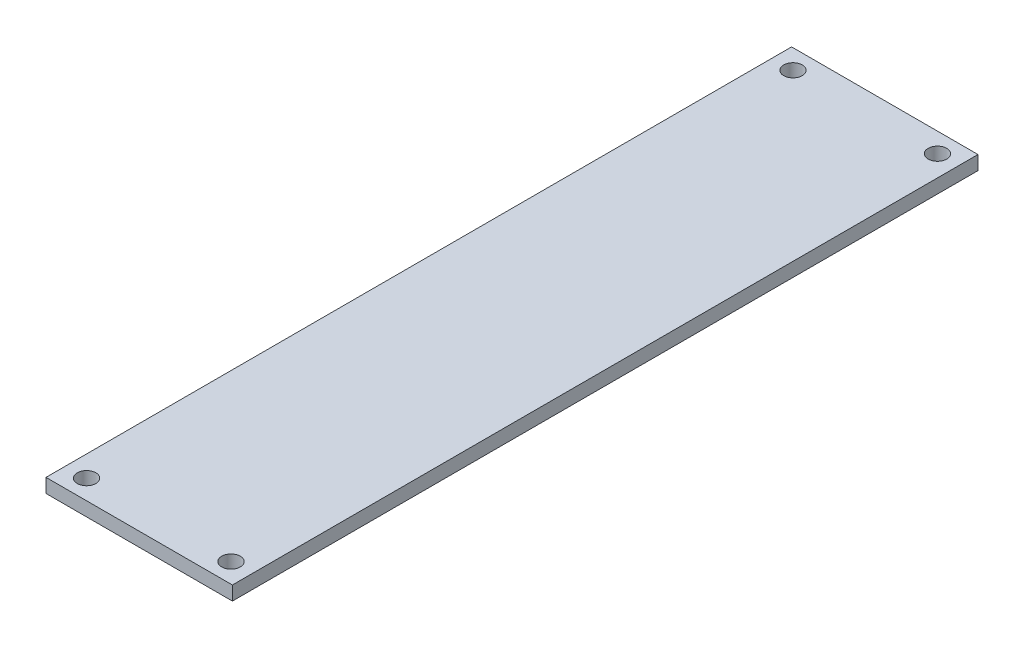
ISO-10303-21;
HEADER;
FILE_DESCRIPTION(('STEP AP214'),'2;1');
FILE_NAME('part.step','',(''),(''),'','','');
FILE_SCHEMA(('AUTOMOTIVE_DESIGN { 1 0 10303 214 1 1 1 1 }'));
ENDSEC;
DATA;
#1=APPLICATION_CONTEXT('core data for automotive mechanical design processes');
#2=APPLICATION_PROTOCOL_DEFINITION('international standard','automotive_design',2000,#1);
#3=PRODUCT_CONTEXT('',#1,'mechanical');
#4=PRODUCT('Part','Part','',(#3));
#5=PRODUCT_RELATED_PRODUCT_CATEGORY('part','',(#4));
#6=PRODUCT_DEFINITION_FORMATION('','',#4);
#7=PRODUCT_DEFINITION_CONTEXT('part definition',#1,'design');
#8=PRODUCT_DEFINITION('design','',#6,#7);
#9=PRODUCT_DEFINITION_SHAPE('','',#8);
#10=(LENGTH_UNIT() NAMED_UNIT(*) SI_UNIT(.MILLI.,.METRE.));
#11=(NAMED_UNIT(*) PLANE_ANGLE_UNIT() SI_UNIT($,.RADIAN.));
#12=(NAMED_UNIT(*) SI_UNIT($,.STERADIAN.) SOLID_ANGLE_UNIT());
#13=UNCERTAINTY_MEASURE_WITH_UNIT(LENGTH_MEASURE(1.E-05),#10,'distance_accuracy_value','');
#14=(GEOMETRIC_REPRESENTATION_CONTEXT(3) GLOBAL_UNCERTAINTY_ASSIGNED_CONTEXT((#13)) GLOBAL_UNIT_ASSIGNED_CONTEXT((#10,
#11,#12)) REPRESENTATION_CONTEXT('',''));
#15=CARTESIAN_POINT('',(0.,0.,0.));
#16=DIRECTION('',(0.,0.,1.));
#17=DIRECTION('',(1.,0.,0.));
#18=AXIS2_PLACEMENT_3D('',#15,#16,#17);
#19=CARTESIAN_POINT('',(0.,1.5,0.));
#20=DIRECTION('',(1.,0.,0.));
#21=DIRECTION('',(0.,0.,-1.));
#22=AXIS2_PLACEMENT_3D('',#19,#20,#21);
#23=PLANE('',#22);
#24=DIRECTION('',(0.,0.,1.));
#25=VECTOR('',#24,1.);
#26=CARTESIAN_POINT('',(0.,0.,0.));
#27=LINE('',#26,#25);
#28=CARTESIAN_POINT('',(0.,0.,-80.));
#29=VERTEX_POINT('',#28);
#30=CARTESIAN_POINT('',(0.,0.,0.));
#31=VERTEX_POINT('',#30);
#32=EDGE_CURVE('E102',#29,#31,#27,.T.);
#33=ORIENTED_EDGE('',*,*,#32,.T.);
#34=DIRECTION('',(0.,-1.,0.));
#35=VECTOR('',#34,1.);
#36=CARTESIAN_POINT('',(0.,1.5,0.));
#37=LINE('',#36,#35);
#38=CARTESIAN_POINT('',(0.,1.5,0.));
#39=VERTEX_POINT('',#38);
#40=EDGE_CURVE('E11',#39,#31,#37,.T.);
#41=ORIENTED_EDGE('',*,*,#40,.F.);
#42=DIRECTION('',(0.,0.,1.));
#43=VECTOR('',#42,1.);
#44=CARTESIAN_POINT('',(0.,1.5,0.));
#45=LINE('',#44,#43);
#46=CARTESIAN_POINT('',(0.,1.5,-80.));
#47=VERTEX_POINT('',#46);
#48=EDGE_CURVE('E90',#47,#39,#45,.T.);
#49=ORIENTED_EDGE('',*,*,#48,.F.);
#50=DIRECTION('',(0.,-1.,0.));
#51=VECTOR('',#50,1.);
#52=CARTESIAN_POINT('',(0.,1.5,-80.));
#53=LINE('',#52,#51);
#54=EDGE_CURVE('E98',#47,#29,#53,.T.);
#55=ORIENTED_EDGE('',*,*,#54,.T.);
#56=EDGE_LOOP('',(#33,#41,#49,#55));
#57=FACE_BOUND('',#56,.T.);
#58=ADVANCED_FACE('F39',(#57),#23,.F.);
#59=CARTESIAN_POINT('',(0.,1.5,0.));
#60=DIRECTION('',(0.,0.,-1.));
#61=DIRECTION('',(-1.,0.,0.));
#62=AXIS2_PLACEMENT_3D('',#59,#60,#61);
#63=PLANE('',#62);
#64=DIRECTION('',(1.,0.,0.));
#65=VECTOR('',#64,1.);
#66=CARTESIAN_POINT('',(0.,0.,0.));
#67=LINE('',#66,#65);
#68=CARTESIAN_POINT('',(20.,0.,0.));
#69=VERTEX_POINT('',#68);
#70=EDGE_CURVE('E94',#31,#69,#67,.T.);
#71=ORIENTED_EDGE('',*,*,#70,.T.);
#72=DIRECTION('',(0.,-1.,0.));
#73=VECTOR('',#72,1.);
#74=CARTESIAN_POINT('',(20.,1.5,0.));
#75=LINE('',#74,#73);
#76=CARTESIAN_POINT('',(20.,1.5,0.));
#77=VERTEX_POINT('',#76);
#78=EDGE_CURVE('E47',#77,#69,#75,.T.);
#79=ORIENTED_EDGE('',*,*,#78,.F.);
#80=DIRECTION('',(1.,0.,0.));
#81=VECTOR('',#80,1.);
#82=CARTESIAN_POINT('',(0.,1.5,0.));
#83=LINE('',#82,#81);
#84=EDGE_CURVE('E85',#39,#77,#83,.T.);
#85=ORIENTED_EDGE('',*,*,#84,.F.);
#86=ORIENTED_EDGE('',*,*,#40,.T.);
#87=EDGE_LOOP('',(#71,#79,#85,#86));
#88=FACE_BOUND('',#87,.T.);
#89=ADVANCED_FACE('F93',(#88),#63,.F.);
#90=CARTESIAN_POINT('',(20.,1.5,0.));
#91=DIRECTION('',(-1.,0.,0.));
#92=DIRECTION('',(0.,0.,1.));
#93=AXIS2_PLACEMENT_3D('',#90,#91,#92);
#94=PLANE('',#93);
#95=DIRECTION('',(0.,0.,-1.));
#96=VECTOR('',#95,1.);
#97=CARTESIAN_POINT('',(20.,0.,0.));
#98=LINE('',#97,#96);
#99=CARTESIAN_POINT('',(20.,0.,-80.));
#100=VERTEX_POINT('',#99);
#101=EDGE_CURVE('E72',#69,#100,#98,.T.);
#102=ORIENTED_EDGE('',*,*,#101,.T.);
#103=DIRECTION('',(0.,-1.,0.));
#104=VECTOR('',#103,1.);
#105=CARTESIAN_POINT('',(20.,1.5,-80.));
#106=LINE('',#105,#104);
#107=CARTESIAN_POINT('',(20.,1.5,-80.));
#108=VERTEX_POINT('',#107);
#109=EDGE_CURVE('E95',#108,#100,#106,.T.);
#110=ORIENTED_EDGE('',*,*,#109,.F.);
#111=DIRECTION('',(0.,0.,-1.));
#112=VECTOR('',#111,1.);
#113=CARTESIAN_POINT('',(20.,1.5,0.));
#114=LINE('',#113,#112);
#115=EDGE_CURVE('E88',#77,#108,#114,.T.);
#116=ORIENTED_EDGE('',*,*,#115,.F.);
#117=ORIENTED_EDGE('',*,*,#78,.T.);
#118=EDGE_LOOP('',(#102,#110,#116,#117));
#119=FACE_BOUND('',#118,.T.);
#120=ADVANCED_FACE('F96',(#119),#94,.F.);
#121=CARTESIAN_POINT('',(0.,1.5,-80.));
#122=DIRECTION('',(0.,0.,1.));
#123=DIRECTION('',(1.,0.,0.));
#124=AXIS2_PLACEMENT_3D('',#121,#122,#123);
#125=PLANE('',#124);
#126=DIRECTION('',(-1.,0.,0.));
#127=VECTOR('',#126,1.);
#128=CARTESIAN_POINT('',(0.,0.,-80.));
#129=LINE('',#128,#127);
#130=EDGE_CURVE('E78',#100,#29,#129,.T.);
#131=ORIENTED_EDGE('',*,*,#130,.T.);
#132=ORIENTED_EDGE('',*,*,#54,.F.);
#133=DIRECTION('',(-1.,0.,0.));
#134=VECTOR('',#133,1.);
#135=CARTESIAN_POINT('',(0.,1.5,-80.));
#136=LINE('',#135,#134);
#137=EDGE_CURVE('E55',#108,#47,#136,.T.);
#138=ORIENTED_EDGE('',*,*,#137,.F.);
#139=ORIENTED_EDGE('',*,*,#109,.T.);
#140=EDGE_LOOP('',(#131,#132,#138,#139));
#141=FACE_BOUND('',#140,.T.);
#142=ADVANCED_FACE('F110',(#141),#125,.F.);
#143=CARTESIAN_POINT('',(0.,1.5,0.));
#144=DIRECTION('',(0.,-1.,0.));
#145=DIRECTION('',(0.,0.,-1.));
#146=AXIS2_PLACEMENT_3D('',#143,#144,#145);
#147=PLANE('',#146);
#148=CARTESIAN_POINT('',(17.75,1.5,-77.9));
#149=DIRECTION('',(0.,1.,0.));
#150=DIRECTION('',(0.,0.,1.));
#151=AXIS2_PLACEMENT_3D('',#148,#149,#150);
#152=CIRCLE('',#151,1.);
#153=CARTESIAN_POINT('',(17.75,1.5,-76.9));
#154=VERTEX_POINT('',#153);
#155=EDGE_CURVE('E119',#154,#154,#152,.T.);
#156=ORIENTED_EDGE('',*,*,#155,.F.);
#157=EDGE_LOOP('',(#156));
#158=FACE_BOUND('',#157,.T.);
#159=CARTESIAN_POINT('',(2.25,1.5,-2.1));
#160=DIRECTION('',(0.,1.,0.));
#161=DIRECTION('',(0.,0.,1.));
#162=AXIS2_PLACEMENT_3D('',#159,#160,#161);
#163=CIRCLE('',#162,1.);
#164=CARTESIAN_POINT('',(2.25,1.5,-1.1));
#165=VERTEX_POINT('',#164);
#166=EDGE_CURVE('E125',#165,#165,#163,.T.);
#167=ORIENTED_EDGE('',*,*,#166,.F.);
#168=EDGE_LOOP('',(#167));
#169=FACE_BOUND('',#168,.T.);
#170=CARTESIAN_POINT('',(17.75,1.5,-2.1));
#171=DIRECTION('',(0.,1.,0.));
#172=DIRECTION('',(0.,0.,1.));
#173=AXIS2_PLACEMENT_3D('',#170,#171,#172);
#174=CIRCLE('',#173,1.);
#175=CARTESIAN_POINT('',(17.75,1.5,-1.1));
#176=VERTEX_POINT('',#175);
#177=EDGE_CURVE('E126',#176,#176,#174,.T.);
#178=ORIENTED_EDGE('',*,*,#177,.F.);
#179=EDGE_LOOP('',(#178));
#180=FACE_BOUND('',#179,.T.);
#181=CARTESIAN_POINT('',(2.25,1.5,-77.9));
#182=DIRECTION('',(0.,1.,0.));
#183=DIRECTION('',(0.,0.,1.));
#184=AXIS2_PLACEMENT_3D('',#181,#182,#183);
#185=CIRCLE('',#184,1.);
#186=CARTESIAN_POINT('',(2.25,1.5,-76.9));
#187=VERTEX_POINT('',#186);
#188=EDGE_CURVE('E116',#187,#187,#185,.T.);
#189=ORIENTED_EDGE('',*,*,#188,.F.);
#190=EDGE_LOOP('',(#189));
#191=FACE_BOUND('',#190,.T.);
#192=ORIENTED_EDGE('',*,*,#48,.T.);
#193=ORIENTED_EDGE('',*,*,#84,.T.);
#194=ORIENTED_EDGE('',*,*,#115,.T.);
#195=ORIENTED_EDGE('',*,*,#137,.T.);
#196=EDGE_LOOP('',(#192,#193,#194,#195));
#197=FACE_BOUND('',#196,.T.);
#198=ADVANCED_FACE('F86',(#158,#169,#180,#191,#197),#147,.F.);
#199=CARTESIAN_POINT('',(0.,0.,0.));
#200=DIRECTION('',(0.,-1.,0.));
#201=DIRECTION('',(0.,0.,-1.));
#202=AXIS2_PLACEMENT_3D('',#199,#200,#201);
#203=PLANE('',#202);
#204=CARTESIAN_POINT('',(17.75,0.,-77.9));
#205=DIRECTION('',(0.,1.,0.));
#206=DIRECTION('',(0.,0.,1.));
#207=AXIS2_PLACEMENT_3D('',#204,#205,#206);
#208=CIRCLE('',#207,1.);
#209=CARTESIAN_POINT('',(17.75,0.,-76.9));
#210=VERTEX_POINT('',#209);
#211=EDGE_CURVE('E129',#210,#210,#208,.T.);
#212=ORIENTED_EDGE('',*,*,#211,.T.);
#213=EDGE_LOOP('',(#212));
#214=FACE_BOUND('',#213,.T.);
#215=CARTESIAN_POINT('',(2.25,0.,-2.1));
#216=DIRECTION('',(0.,1.,0.));
#217=DIRECTION('',(0.,0.,1.));
#218=AXIS2_PLACEMENT_3D('',#215,#216,#217);
#219=CIRCLE('',#218,1.);
#220=CARTESIAN_POINT('',(2.25,0.,-1.1));
#221=VERTEX_POINT('',#220);
#222=EDGE_CURVE('E122',#221,#221,#219,.T.);
#223=ORIENTED_EDGE('',*,*,#222,.T.);
#224=EDGE_LOOP('',(#223));
#225=FACE_BOUND('',#224,.T.);
#226=CARTESIAN_POINT('',(17.75,0.,-2.1));
#227=DIRECTION('',(0.,1.,0.));
#228=DIRECTION('',(0.,0.,1.));
#229=AXIS2_PLACEMENT_3D('',#226,#227,#228);
#230=CIRCLE('',#229,1.);
#231=CARTESIAN_POINT('',(17.75,0.,-1.1));
#232=VERTEX_POINT('',#231);
#233=EDGE_CURVE('E134',#232,#232,#230,.T.);
#234=ORIENTED_EDGE('',*,*,#233,.T.);
#235=EDGE_LOOP('',(#234));
#236=FACE_BOUND('',#235,.T.);
#237=CARTESIAN_POINT('',(2.25,0.,-77.9));
#238=DIRECTION('',(0.,1.,0.));
#239=DIRECTION('',(0.,0.,1.));
#240=AXIS2_PLACEMENT_3D('',#237,#238,#239);
#241=CIRCLE('',#240,1.);
#242=CARTESIAN_POINT('',(2.25,0.,-76.9));
#243=VERTEX_POINT('',#242);
#244=EDGE_CURVE('E105',#243,#243,#241,.T.);
#245=ORIENTED_EDGE('',*,*,#244,.T.);
#246=EDGE_LOOP('',(#245));
#247=FACE_BOUND('',#246,.T.);
#248=ORIENTED_EDGE('',*,*,#32,.F.);
#249=ORIENTED_EDGE('',*,*,#130,.F.);
#250=ORIENTED_EDGE('',*,*,#101,.F.);
#251=ORIENTED_EDGE('',*,*,#70,.F.);
#252=EDGE_LOOP('',(#248,#249,#250,#251));
#253=FACE_BOUND('',#252,.T.);
#254=ADVANCED_FACE('F113',(#214,#225,#236,#247,#253),#203,.T.);
#255=CARTESIAN_POINT('',(2.25,0.,-77.9));
#256=DIRECTION('',(0.,1.,0.));
#257=DIRECTION('',(0.,0.,1.));
#258=AXIS2_PLACEMENT_3D('',#255,#256,#257);
#259=CYLINDRICAL_SURFACE('',#258,1.);
#260=ORIENTED_EDGE('',*,*,#244,.F.);
#261=EDGE_LOOP('',(#260));
#262=FACE_BOUND('',#261,.T.);
#263=ORIENTED_EDGE('',*,*,#188,.T.);
#264=EDGE_LOOP('',(#263));
#265=FACE_BOUND('',#264,.T.);
#266=ADVANCED_FACE('F148',(#262,#265),#259,.F.);
#267=CARTESIAN_POINT('',(17.75,0.,-2.1));
#268=DIRECTION('',(0.,1.,0.));
#269=DIRECTION('',(0.,0.,1.));
#270=AXIS2_PLACEMENT_3D('',#267,#268,#269);
#271=CYLINDRICAL_SURFACE('',#270,1.);
#272=ORIENTED_EDGE('',*,*,#233,.F.);
#273=EDGE_LOOP('',(#272));
#274=FACE_BOUND('',#273,.T.);
#275=ORIENTED_EDGE('',*,*,#177,.T.);
#276=EDGE_LOOP('',(#275));
#277=FACE_BOUND('',#276,.T.);
#278=ADVANCED_FACE('F140',(#274,#277),#271,.F.);
#279=CARTESIAN_POINT('',(2.25,0.,-2.1));
#280=DIRECTION('',(0.,1.,0.));
#281=DIRECTION('',(0.,0.,1.));
#282=AXIS2_PLACEMENT_3D('',#279,#280,#281);
#283=CYLINDRICAL_SURFACE('',#282,1.);
#284=ORIENTED_EDGE('',*,*,#222,.F.);
#285=EDGE_LOOP('',(#284));
#286=FACE_BOUND('',#285,.T.);
#287=ORIENTED_EDGE('',*,*,#166,.T.);
#288=EDGE_LOOP('',(#287));
#289=FACE_BOUND('',#288,.T.);
#290=ADVANCED_FACE('F156',(#286,#289),#283,.F.);
#291=CARTESIAN_POINT('',(17.75,0.,-77.9));
#292=DIRECTION('',(0.,1.,0.));
#293=DIRECTION('',(0.,0.,1.));
#294=AXIS2_PLACEMENT_3D('',#291,#292,#293);
#295=CYLINDRICAL_SURFACE('',#294,1.);
#296=ORIENTED_EDGE('',*,*,#211,.F.);
#297=EDGE_LOOP('',(#296));
#298=FACE_BOUND('',#297,.T.);
#299=ORIENTED_EDGE('',*,*,#155,.T.);
#300=EDGE_LOOP('',(#299));
#301=FACE_BOUND('',#300,.T.);
#302=ADVANCED_FACE('F213',(#298,#301),#295,.F.);
#303=CLOSED_SHELL('',(#58,#89,#120,#142,#198,#254,#266,#278,#290,#302));
#304=MANIFOLD_SOLID_BREP('B2',#303);
#305=ADVANCED_BREP_SHAPE_REPRESENTATION('',(#18,#304),#14);
#306=SHAPE_DEFINITION_REPRESENTATION(#9,#305);
ENDSEC;
END-ISO-10303-21;
